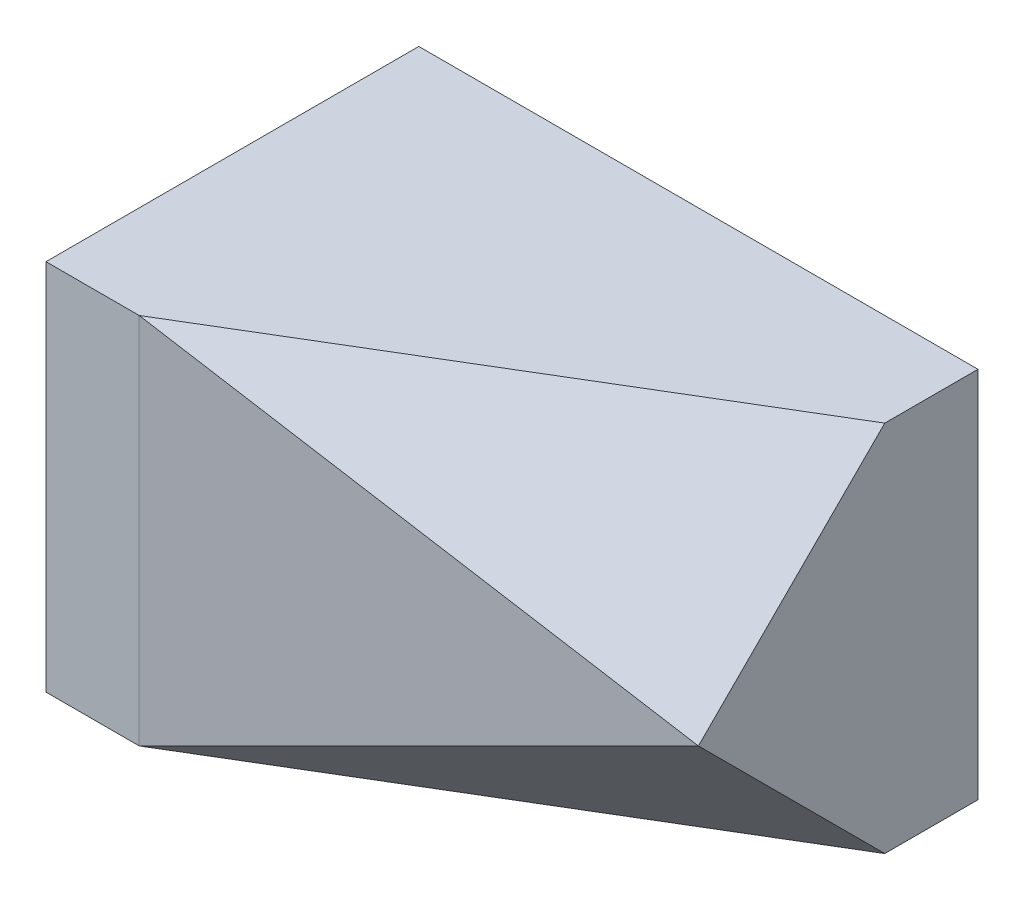
ISO-10303-21;
HEADER;
FILE_DESCRIPTION(('STEP AP214'),'2;1');
FILE_NAME('part.step','',(''),(''),'','','');
FILE_SCHEMA(('AUTOMOTIVE_DESIGN { 1 0 10303 214 1 1 1 1 }'));
ENDSEC;
DATA;
#1=APPLICATION_CONTEXT('core data for automotive mechanical design processes');
#2=APPLICATION_PROTOCOL_DEFINITION('international standard','automotive_design',2000,#1);
#3=PRODUCT_CONTEXT('',#1,'mechanical');
#4=PRODUCT('Part','Part','',(#3));
#5=PRODUCT_RELATED_PRODUCT_CATEGORY('part','',(#4));
#6=PRODUCT_DEFINITION_FORMATION('','',#4);
#7=PRODUCT_DEFINITION_CONTEXT('part definition',#1,'design');
#8=PRODUCT_DEFINITION('design','',#6,#7);
#9=PRODUCT_DEFINITION_SHAPE('','',#8);
#10=(LENGTH_UNIT() NAMED_UNIT(*) SI_UNIT(.MILLI.,.METRE.));
#11=(NAMED_UNIT(*) PLANE_ANGLE_UNIT() SI_UNIT($,.RADIAN.));
#12=(NAMED_UNIT(*) SI_UNIT($,.STERADIAN.) SOLID_ANGLE_UNIT());
#13=UNCERTAINTY_MEASURE_WITH_UNIT(LENGTH_MEASURE(1.E-05),#10,'distance_accuracy_value','');
#14=(GEOMETRIC_REPRESENTATION_CONTEXT(3) GLOBAL_UNCERTAINTY_ASSIGNED_CONTEXT((#13)) GLOBAL_UNIT_ASSIGNED_CONTEXT((#10,
#11,#12)) REPRESENTATION_CONTEXT('',''));
#15=CARTESIAN_POINT('',(0.,0.,0.));
#16=DIRECTION('',(0.,0.,1.));
#17=DIRECTION('',(1.,0.,0.));
#18=AXIS2_PLACEMENT_3D('',#15,#16,#17);
#19=CARTESIAN_POINT('',(0.,1016.,1016.));
#20=DIRECTION('',(0.,1.,0.));
#21=DIRECTION('',(0.,0.,1.));
#22=AXIS2_PLACEMENT_3D('',#19,#20,#21);
#23=PLANE('',#22);
#24=DIRECTION('',(-0.857492925712544,0.,0.514495755427527));
#25=VECTOR('',#24,1.);
#26=CARTESIAN_POINT('',(67.2352941176473,1016.,1128.05882352941));
#27=LINE('',#26,#25);
#28=CARTESIAN_POINT('',(1524.,1016.,254.000000000001));
#29=VERTEX_POINT('',#28);
#30=CARTESIAN_POINT('',(254.000000000001,1016.,1016.));
#31=VERTEX_POINT('',#30);
#32=EDGE_CURVE('E83',#29,#31,#27,.T.);
#33=ORIENTED_EDGE('',*,*,#32,.F.);
#34=DIRECTION('',(0.,0.,-1.));
#35=VECTOR('',#34,1.);
#36=CARTESIAN_POINT('',(1524.,1016.,1016.));
#37=LINE('',#36,#35);
#38=CARTESIAN_POINT('',(1524.,1016.,0.));
#39=VERTEX_POINT('',#38);
#40=EDGE_CURVE('E78',#29,#39,#37,.T.);
#41=ORIENTED_EDGE('',*,*,#40,.T.);
#42=DIRECTION('',(1.,0.,0.));
#43=VECTOR('',#42,1.);
#44=CARTESIAN_POINT('',(0.,1016.,0.));
#45=LINE('',#44,#43);
#46=CARTESIAN_POINT('',(0.,1016.,0.));
#47=VERTEX_POINT('',#46);
#48=EDGE_CURVE('E80',#47,#39,#45,.T.);
#49=ORIENTED_EDGE('',*,*,#48,.F.);
#50=DIRECTION('',(0.,0.,-1.));
#51=VECTOR('',#50,1.);
#52=CARTESIAN_POINT('',(0.,1016.,1016.));
#53=LINE('',#52,#51);
#54=CARTESIAN_POINT('',(0.,1016.,1016.));
#55=VERTEX_POINT('',#54);
#56=EDGE_CURVE('E43',#55,#47,#53,.T.);
#57=ORIENTED_EDGE('',*,*,#56,.F.);
#58=DIRECTION('',(1.,0.,0.));
#59=VECTOR('',#58,1.);
#60=CARTESIAN_POINT('',(0.,1016.,1016.));
#61=LINE('',#60,#59);
#62=EDGE_CURVE('E100',#55,#31,#61,.T.);
#63=ORIENTED_EDGE('',*,*,#62,.T.);
#64=EDGE_LOOP('',(#33,#41,#49,#57,#63));
#65=FACE_BOUND('',#64,.T.);
#66=ADVANCED_FACE('F36',(#65),#23,.T.);
#67=CARTESIAN_POINT('',(0.,0.,1016.));
#68=DIRECTION('',(-1.,0.,0.));
#69=DIRECTION('',(0.,0.,1.));
#70=AXIS2_PLACEMENT_3D('',#67,#68,#69);
#71=PLANE('',#70);
#72=DIRECTION('',(0.,1.,0.));
#73=VECTOR('',#72,1.);
#74=CARTESIAN_POINT('',(0.,0.,0.));
#75=LINE('',#74,#73);
#76=CARTESIAN_POINT('',(0.,0.,0.));
#77=VERTEX_POINT('',#76);
#78=EDGE_CURVE('E94',#77,#47,#75,.T.);
#79=ORIENTED_EDGE('',*,*,#78,.F.);
#80=DIRECTION('',(0.,0.,-1.));
#81=VECTOR('',#80,1.);
#82=CARTESIAN_POINT('',(0.,0.,1016.));
#83=LINE('',#82,#81);
#84=CARTESIAN_POINT('',(0.,0.,1016.));
#85=VERTEX_POINT('',#84);
#86=EDGE_CURVE('E109',#85,#77,#83,.T.);
#87=ORIENTED_EDGE('',*,*,#86,.F.);
#88=DIRECTION('',(0.,1.,0.));
#89=VECTOR('',#88,1.);
#90=CARTESIAN_POINT('',(0.,0.,1016.));
#91=LINE('',#90,#89);
#92=EDGE_CURVE('E103',#85,#55,#91,.T.);
#93=ORIENTED_EDGE('',*,*,#92,.T.);
#94=ORIENTED_EDGE('',*,*,#56,.T.);
#95=EDGE_LOOP('',(#79,#87,#93,#94));
#96=FACE_BOUND('',#95,.T.);
#97=ADVANCED_FACE('F112',(#96),#71,.T.);
#98=CARTESIAN_POINT('',(0.,0.,1016.));
#99=DIRECTION('',(0.,-1.,0.));
#100=DIRECTION('',(1.,0.,0.));
#101=AXIS2_PLACEMENT_3D('',#98,#99,#100);
#102=PLANE('',#101);
#103=DIRECTION('',(0.857492925712544,0.,-0.514495755427527));
#104=VECTOR('',#103,1.);
#105=CARTESIAN_POINT('',(67.2352941176471,0.,1128.05882352941));
#106=LINE('',#105,#104);
#107=CARTESIAN_POINT('',(254.,0.,1016.));
#108=VERTEX_POINT('',#107);
#109=CARTESIAN_POINT('',(1524.,0.,254.));
#110=VERTEX_POINT('',#109);
#111=EDGE_CURVE('E131',#108,#110,#106,.T.);
#112=ORIENTED_EDGE('',*,*,#111,.F.);
#113=DIRECTION('',(-1.,0.,0.));
#114=VECTOR('',#113,1.);
#115=CARTESIAN_POINT('',(0.,0.,1016.));
#116=LINE('',#115,#114);
#117=EDGE_CURVE('E59',#108,#85,#116,.T.);
#118=ORIENTED_EDGE('',*,*,#117,.T.);
#119=ORIENTED_EDGE('',*,*,#86,.T.);
#120=DIRECTION('',(-1.,0.,0.));
#121=VECTOR('',#120,1.);
#122=CARTESIAN_POINT('',(0.,0.,0.));
#123=LINE('',#122,#121);
#124=CARTESIAN_POINT('',(1524.,0.,0.));
#125=VERTEX_POINT('',#124);
#126=EDGE_CURVE('E101',#125,#77,#123,.T.);
#127=ORIENTED_EDGE('',*,*,#126,.F.);
#128=DIRECTION('',(0.,0.,-1.));
#129=VECTOR('',#128,1.);
#130=CARTESIAN_POINT('',(1524.,0.,1016.));
#131=LINE('',#130,#129);
#132=EDGE_CURVE('E86',#110,#125,#131,.T.);
#133=ORIENTED_EDGE('',*,*,#132,.F.);
#134=EDGE_LOOP('',(#112,#118,#119,#127,#133));
#135=FACE_BOUND('',#134,.T.);
#136=ADVANCED_FACE('F144',(#135),#102,.T.);
#137=CARTESIAN_POINT('',(1524.,6.66133814775094E-13,1016.));
#138=DIRECTION('',(1.,0.,0.));
#139=DIRECTION('',(0.,1.,0.));
#140=AXIS2_PLACEMENT_3D('',#137,#138,#139);
#141=PLANE('',#140);
#142=DIRECTION('',(0.,0.707106781186547,0.707106781186548));
#143=VECTOR('',#142,1.);
#144=CARTESIAN_POINT('',(1524.,381.000000000001,635.));
#145=LINE('',#144,#143);
#146=CARTESIAN_POINT('',(1524.,508.,762.));
#147=VERTEX_POINT('',#146);
#148=EDGE_CURVE('E127',#110,#147,#145,.T.);
#149=ORIENTED_EDGE('',*,*,#148,.F.);
#150=ORIENTED_EDGE('',*,*,#132,.T.);
#151=DIRECTION('',(0.,-1.,0.));
#152=VECTOR('',#151,1.);
#153=CARTESIAN_POINT('',(1524.,6.66133814775094E-13,0.));
#154=LINE('',#153,#152);
#155=EDGE_CURVE('E92',#39,#125,#154,.T.);
#156=ORIENTED_EDGE('',*,*,#155,.F.);
#157=ORIENTED_EDGE('',*,*,#40,.F.);
#158=DIRECTION('',(0.,0.707106781186548,-0.707106781186547));
#159=VECTOR('',#158,1.);
#160=CARTESIAN_POINT('',(1524.,127.,1143.));
#161=LINE('',#160,#159);
#162=EDGE_CURVE('E50',#147,#29,#161,.T.);
#163=ORIENTED_EDGE('',*,*,#162,.F.);
#164=EDGE_LOOP('',(#149,#150,#156,#157,#163));
#165=FACE_BOUND('',#164,.T.);
#166=ADVANCED_FACE('F97',(#165),#141,.T.);
#167=CARTESIAN_POINT('',(0.,0.,1016.));
#168=DIRECTION('',(0.,0.,1.));
#169=DIRECTION('',(1.,0.,0.));
#170=AXIS2_PLACEMENT_3D('',#167,#168,#169);
#171=PLANE('',#170);
#172=DIRECTION('',(0.,-1.,0.));
#173=VECTOR('',#172,1.);
#174=CARTESIAN_POINT('',(253.999999999999,0.,1016.));
#175=LINE('',#174,#173);
#176=EDGE_CURVE('E120',#31,#108,#175,.T.);
#177=ORIENTED_EDGE('',*,*,#176,.F.);
#178=ORIENTED_EDGE('',*,*,#62,.F.);
#179=ORIENTED_EDGE('',*,*,#92,.F.);
#180=ORIENTED_EDGE('',*,*,#117,.F.);
#181=EDGE_LOOP('',(#177,#178,#179,#180));
#182=FACE_BOUND('',#181,.T.);
#183=ADVANCED_FACE('F118',(#182),#171,.T.);
#184=CARTESIAN_POINT('',(0.,0.,0.));
#185=DIRECTION('',(0.,0.,1.));
#186=DIRECTION('',(1.,0.,0.));
#187=AXIS2_PLACEMENT_3D('',#184,#185,#186);
#188=PLANE('',#187);
#189=ORIENTED_EDGE('',*,*,#48,.T.);
#190=ORIENTED_EDGE('',*,*,#155,.T.);
#191=ORIENTED_EDGE('',*,*,#126,.T.);
#192=ORIENTED_EDGE('',*,*,#78,.T.);
#193=EDGE_LOOP('',(#189,#190,#191,#192));
#194=FACE_BOUND('',#193,.T.);
#195=ADVANCED_FACE('F90',(#194),#188,.F.);
#196=CARTESIAN_POINT('',(555.35593220339,925.593220338983,925.593220338983));
#197=DIRECTION('',(-0.390566732942472,-0.650944554904119,-0.650944554904119));
#198=DIRECTION('',(0.,0.707106781186548,-0.707106781186547));
#199=AXIS2_PLACEMENT_3D('',#196,#197,#198);
#200=PLANE('',#199);
#201=ORIENTED_EDGE('',*,*,#32,.T.);
#202=DIRECTION('',(0.912870929175277,-0.365148371670111,-0.182574185835055));
#203=VECTOR('',#202,1.);
#204=CARTESIAN_POINT('',(550.333333333334,897.466666666667,956.733333333333));
#205=LINE('',#204,#203);
#206=EDGE_CURVE('E128',#31,#147,#205,.T.);
#207=ORIENTED_EDGE('',*,*,#206,.T.);
#208=ORIENTED_EDGE('',*,*,#162,.T.);
#209=EDGE_LOOP('',(#201,#207,#208));
#210=FACE_BOUND('',#209,.T.);
#211=ADVANCED_FACE('F140',(#210),#200,.F.);
#212=CARTESIAN_POINT('',(297.050847457627,-495.084745762712,495.084745762712));
#213=DIRECTION('',(-0.390566732942472,0.650944554904119,-0.650944554904119));
#214=DIRECTION('',(0.,0.707106781186548,0.707106781186548));
#215=AXIS2_PLACEMENT_3D('',#212,#213,#214);
#216=PLANE('',#215);
#217=ORIENTED_EDGE('',*,*,#148,.T.);
#218=DIRECTION('',(-0.912870929175277,-0.365148371670111,0.182574185835055));
#219=VECTOR('',#218,1.);
#220=CARTESIAN_POINT('',(211.666666666667,-16.9333333333335,1024.46666666667));
#221=LINE('',#220,#219);
#222=EDGE_CURVE('E12',#147,#108,#221,.T.);
#223=ORIENTED_EDGE('',*,*,#222,.T.);
#224=ORIENTED_EDGE('',*,*,#111,.T.);
#225=EDGE_LOOP('',(#217,#223,#224));
#226=FACE_BOUND('',#225,.T.);
#227=ADVANCED_FACE('F143',(#226),#216,.F.);
#228=CARTESIAN_POINT('',(205.153846153846,0.,1025.76923076923));
#229=DIRECTION('',(-0.196116135138184,0.,-0.98058067569092));
#230=DIRECTION('',(-0.98058067569092,0.,0.196116135138184));
#231=AXIS2_PLACEMENT_3D('',#228,#229,#230);
#232=PLANE('',#231);
#233=ORIENTED_EDGE('',*,*,#206,.F.);
#234=ORIENTED_EDGE('',*,*,#176,.T.);
#235=ORIENTED_EDGE('',*,*,#222,.F.);
#236=EDGE_LOOP('',(#233,#234,#235));
#237=FACE_BOUND('',#236,.T.);
#238=ADVANCED_FACE('F187',(#237),#232,.F.);
#239=CLOSED_SHELL('',(#66,#97,#136,#166,#183,#195,#211,#227,#238));
#240=MANIFOLD_SOLID_BREP('B2',#239);
#241=ADVANCED_BREP_SHAPE_REPRESENTATION('',(#18,#240),#14);
#242=SHAPE_DEFINITION_REPRESENTATION(#9,#241);
ENDSEC;
END-ISO-10303-21;
